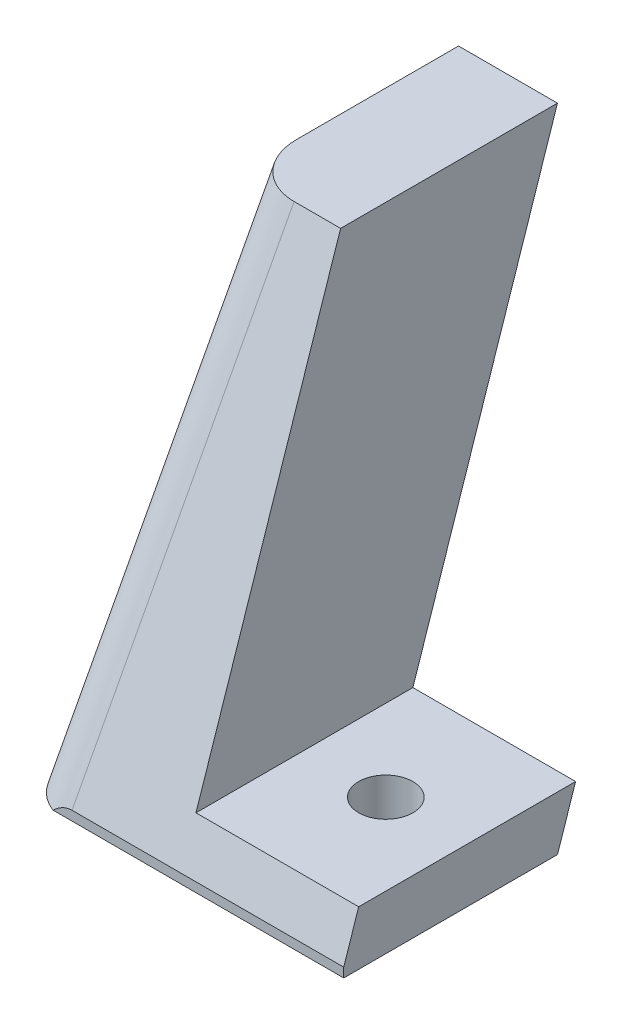
ISO-10303-21;
HEADER;
FILE_DESCRIPTION(('STEP AP214'),'2;1');
FILE_NAME('part.step','',(''),(''),'','','');
FILE_SCHEMA(('AUTOMOTIVE_DESIGN { 1 0 10303 214 1 1 1 1 }'));
ENDSEC;
DATA;
#1=APPLICATION_CONTEXT('core data for automotive mechanical design processes');
#2=APPLICATION_PROTOCOL_DEFINITION('international standard','automotive_design',2000,#1);
#3=PRODUCT_CONTEXT('',#1,'mechanical');
#4=PRODUCT('Part','Part','',(#3));
#5=PRODUCT_RELATED_PRODUCT_CATEGORY('part','',(#4));
#6=PRODUCT_DEFINITION_FORMATION('','',#4);
#7=PRODUCT_DEFINITION_CONTEXT('part definition',#1,'design');
#8=PRODUCT_DEFINITION('design','',#6,#7);
#9=PRODUCT_DEFINITION_SHAPE('','',#8);
#10=(LENGTH_UNIT() NAMED_UNIT(*) SI_UNIT(.MILLI.,.METRE.));
#11=(NAMED_UNIT(*) PLANE_ANGLE_UNIT() SI_UNIT($,.RADIAN.));
#12=(NAMED_UNIT(*) SI_UNIT($,.STERADIAN.) SOLID_ANGLE_UNIT());
#13=UNCERTAINTY_MEASURE_WITH_UNIT(LENGTH_MEASURE(1.E-05),#10,'distance_accuracy_value','');
#14=(GEOMETRIC_REPRESENTATION_CONTEXT(3) GLOBAL_UNCERTAINTY_ASSIGNED_CONTEXT((#13)) GLOBAL_UNIT_ASSIGNED_CONTEXT((#10,
#11,#12)) REPRESENTATION_CONTEXT('',''));
#15=CARTESIAN_POINT('',(0.,0.,0.));
#16=DIRECTION('',(0.,0.,1.));
#17=DIRECTION('',(1.,0.,0.));
#18=AXIS2_PLACEMENT_3D('',#15,#16,#17);
#19=CARTESIAN_POINT('',(-39.546029552466,3.15221063663496,43.9677703351891));
#20=DIRECTION('',(0.122916675240222,0.941489427371917,-0.313829809123972));
#21=DIRECTION('',(0.,0.316227766016838,0.948683298050514));
#22=AXIS2_PLACEMENT_3D('',#19,#20,#21);
#23=CYLINDRICAL_SURFACE('',#22,5.);
#24=DIRECTION('',(0.122916675240222,0.941489427371917,-0.313829809123972));
#25=VECTOR('',#24,1.);
#26=CARTESIAN_POINT('',(-44.5039547778189,3.79949531883381,43.9677703351891));
#27=LINE('',#26,#25);
#28=CARTESIAN_POINT('',(-45.,0.,45.2342687748004));
#29=VERTEX_POINT('',#28);
#30=CARTESIAN_POINT('',(-39.125,45.,30.2342687748004));
#31=VERTEX_POINT('',#30);
#32=EDGE_CURVE('E155',#29,#31,#27,.T.);
#33=ORIENTED_EDGE('',*,*,#32,.F.);
#34=CARTESIAN_POINT('',(-39.95756816336,0.,45.0185072140674));
#35=DIRECTION('',(0.,1.,0.));
#36=DIRECTION('',(0.364691898216784,0.,-0.931128250766262));
#37=AXIS2_PLACEMENT_3D('',#34,#35,#36);
#38=ELLIPSE('',#37,5.31073409284802,5.);
#39=CARTESIAN_POINT('',(-41.7980209045534,0.,50.));
#40=VERTEX_POINT('',#39);
#41=EDGE_CURVE('E43',#40,#29,#38,.F.);
#42=ORIENTED_EDGE('',*,*,#41,.F.);
#43=CARTESIAN_POINT('',(-41.9086528378502,-14.9444783577977,50.));
#44=DIRECTION('',(0.,0.,1.));
#45=DIRECTION('',(0.12945693643977,0.991585045070583,0.));
#46=AXIS2_PLACEMENT_3D('',#43,#44,#45);
#47=ELLIPSE('',#46,15.9322022785441,5.);
#48=CARTESIAN_POINT('',(-40.0508147125013,0.866909943044184,50.));
#49=VERTEX_POINT('',#48);
#50=EDGE_CURVE('E162',#49,#40,#47,.T.);
#51=ORIENTED_EDGE('',*,*,#50,.F.);
#52=DIRECTION('',(0.122916675240222,0.941489427371917,-0.313829809123972));
#53=VECTOR('',#52,1.);
#54=CARTESIAN_POINT('',(-40.3126019980263,-1.13826926523191,50.6683930694254));
#55=LINE('',#54,#53);
#56=CARTESIAN_POINT('',(-34.288994621709,45.0000000001769,35.2889699809558));
#57=VERTEX_POINT('',#56);
#58=EDGE_CURVE('E158',#57,#49,#55,.F.);
#59=ORIENTED_EDGE('',*,*,#58,.F.);
#60=CARTESIAN_POINT('',(-34.08256816336,45.,30.0185072140674));
#61=DIRECTION('',(0.,1.,0.));
#62=DIRECTION('',(0.364691898216784,0.,-0.931128250766262));
#63=AXIS2_PLACEMENT_3D('',#60,#61,#62);
#64=ELLIPSE('',#63,5.31073409284802,5.);
#65=EDGE_CURVE('E11',#31,#57,#64,.T.);
#66=ORIENTED_EDGE('',*,*,#65,.F.);
#67=EDGE_LOOP('',(#33,#42,#51,#59,#66));
#68=FACE_BOUND('',#67,.T.);
#69=ADVANCED_FACE('F36',(#68),#23,.T.);
#70=CARTESIAN_POINT('',(-30.,0.,50.));
#71=DIRECTION('',(-1.,0.,0.));
#72=DIRECTION('',(0.,0.,1.));
#73=AXIS2_PLACEMENT_3D('',#70,#71,#72);
#74=PLANE('',#73);
#75=DIRECTION('',(0.,0.,1.));
#76=VECTOR('',#75,1.);
#77=CARTESIAN_POINT('',(-30.,5.,48.6223033143481));
#78=LINE('',#77,#76);
#79=CARTESIAN_POINT('',(-30.,5.,28.6227831519458));
#80=VERTEX_POINT('',#79);
#81=CARTESIAN_POINT('',(-30.,5.,48.6223033143481));
#82=VERTEX_POINT('',#81);
#83=EDGE_CURVE('E126',#80,#82,#78,.T.);
#84=ORIENTED_EDGE('',*,*,#83,.F.);
#85=DIRECTION('',(0.,-0.948710608132915,0.316145823973803));
#86=VECTOR('',#85,1.);
#87=CARTESIAN_POINT('',(-30.,-5.9119469128284,32.2590515970766));
#88=LINE('',#87,#86);
#89=CARTESIAN_POINT('',(-30.,45.,15.2932885193357));
#90=VERTEX_POINT('',#89);
#91=EDGE_CURVE('E145',#90,#80,#88,.T.);
#92=ORIENTED_EDGE('',*,*,#91,.F.);
#93=DIRECTION('',(0.,0.,-1.));
#94=VECTOR('',#93,1.);
#95=CARTESIAN_POINT('',(-30.,45.,50.));
#96=LINE('',#95,#94);
#97=CARTESIAN_POINT('',(-30.,45.0000000001769,35.2889699809558));
#98=VERTEX_POINT('',#97);
#99=EDGE_CURVE('E168',#98,#90,#96,.T.);
#100=ORIENTED_EDGE('',*,*,#99,.F.);
#101=DIRECTION('',(0.,-0.948683298050514,0.316227766016838));
#102=VECTOR('',#101,1.);
#103=CARTESIAN_POINT('',(-30.,0.0866909943044183,50.2600729829133));
#104=LINE('',#103,#102);
#105=EDGE_CURVE('E109',#98,#82,#104,.T.);
#106=ORIENTED_EDGE('',*,*,#105,.T.);
#107=EDGE_LOOP('',(#84,#92,#100,#106));
#108=FACE_BOUND('',#107,.T.);
#109=ADVANCED_FACE('F192',(#108),#74,.F.);
#110=CARTESIAN_POINT('',(0.,45.,50.));
#111=DIRECTION('',(0.,1.,0.));
#112=DIRECTION('',(0.,0.,1.));
#113=AXIS2_PLACEMENT_3D('',#110,#111,#112);
#114=PLANE('',#113);
#115=DIRECTION('',(0.,0.,-1.));
#116=VECTOR('',#115,1.);
#117=CARTESIAN_POINT('',(-39.125,45.,50.));
#118=LINE('',#117,#116);
#119=CARTESIAN_POINT('',(-39.1249999999769,45.0000000001769,15.2932885193357));
#120=VERTEX_POINT('',#119);
#121=EDGE_CURVE('E167',#31,#120,#118,.T.);
#122=ORIENTED_EDGE('',*,*,#121,.F.);
#123=ORIENTED_EDGE('',*,*,#65,.T.);
#124=DIRECTION('',(1.,0.,0.));
#125=VECTOR('',#124,1.);
#126=CARTESIAN_POINT('',(-50.,45.0000000001769,35.2889699809558));
#127=LINE('',#126,#125);
#128=EDGE_CURVE('E141',#57,#98,#127,.T.);
#129=ORIENTED_EDGE('',*,*,#128,.T.);
#130=ORIENTED_EDGE('',*,*,#99,.T.);
#131=DIRECTION('',(1.,0.,0.));
#132=VECTOR('',#131,1.);
#133=CARTESIAN_POINT('',(-50.,45.0000000001769,15.2932885193357));
#134=LINE('',#133,#132);
#135=EDGE_CURVE('E108',#120,#90,#134,.T.);
#136=ORIENTED_EDGE('',*,*,#135,.F.);
#137=EDGE_LOOP('',(#122,#123,#129,#130,#136));
#138=FACE_BOUND('',#137,.T.);
#139=ADVANCED_FACE('F188',(#138),#114,.T.);
#140=CARTESIAN_POINT('',(-44.2458405723433,5.77654029694479,50.));
#141=DIRECTION('',(0.991585045070583,-0.12945693643977,0.));
#142=DIRECTION('',(0.12945693643977,0.991585045070583,0.));
#143=AXIS2_PLACEMENT_3D('',#140,#141,#142);
#144=PLANE('',#143);
#145=DIRECTION('',(0.,0.,-1.));
#146=VECTOR('',#145,1.);
#147=CARTESIAN_POINT('',(-45.,0.,50.));
#148=LINE('',#147,#146);
#149=CARTESIAN_POINT('',(-45.,0.,30.2889699810147));
#150=VERTEX_POINT('',#149);
#151=EDGE_CURVE('E104',#29,#150,#148,.T.);
#152=ORIENTED_EDGE('',*,*,#151,.F.);
#153=ORIENTED_EDGE('',*,*,#32,.T.);
#154=ORIENTED_EDGE('',*,*,#121,.T.);
#155=DIRECTION('',(0.122920160223209,0.94151612085863,-0.313748351986139));
#156=VECTOR('',#155,1.);
#157=CARTESIAN_POINT('',(-45.0802540777776,-0.614712085105077,30.493815016989));
#158=LINE('',#157,#156);
#159=EDGE_CURVE('E166',#150,#120,#158,.T.);
#160=ORIENTED_EDGE('',*,*,#159,.F.);
#161=EDGE_LOOP('',(#152,#153,#154,#160));
#162=FACE_BOUND('',#161,.T.);
#163=ADVANCED_FACE('F165',(#162),#144,.F.);
#164=CARTESIAN_POINT('',(0.,0.,50.));
#165=DIRECTION('',(0.,1.,0.));
#166=DIRECTION('',(-1.,0.,0.));
#167=AXIS2_PLACEMENT_3D('',#164,#165,#166);
#168=PLANE('',#167);
#169=CARTESIAN_POINT('',(-22.5,0.,38.6225432331469));
#170=DIRECTION('',(0.,1.,0.));
#171=DIRECTION('',(-1.,0.,0.));
#172=AXIS2_PLACEMENT_3D('',#169,#170,#171);
#173=CIRCLE('',#172,2.5);
#174=CARTESIAN_POINT('',(-25.,0.,38.6225432331469));
#175=VERTEX_POINT('',#174);
#176=EDGE_CURVE('E129',#175,#175,#173,.T.);
#177=ORIENTED_EDGE('',*,*,#176,.T.);
#178=EDGE_LOOP('',(#177));
#179=FACE_BOUND('',#178,.T.);
#180=DIRECTION('',(1.,0.,0.));
#181=VECTOR('',#180,1.);
#182=CARTESIAN_POINT('',(0.,0.,50.));
#183=LINE('',#182,#181);
#184=CARTESIAN_POINT('',(-15.,0.,50.));
#185=VERTEX_POINT('',#184);
#186=EDGE_CURVE('E163',#40,#185,#183,.T.);
#187=ORIENTED_EDGE('',*,*,#186,.F.);
#188=ORIENTED_EDGE('',*,*,#41,.T.);
#189=ORIENTED_EDGE('',*,*,#151,.T.);
#190=DIRECTION('',(1.,0.,0.));
#191=VECTOR('',#190,1.);
#192=CARTESIAN_POINT('',(-50.,0.,30.2889699810147));
#193=LINE('',#192,#191);
#194=CARTESIAN_POINT('',(-15.,0.,30.2889699810147));
#195=VERTEX_POINT('',#194);
#196=EDGE_CURVE('E97',#150,#195,#193,.T.);
#197=ORIENTED_EDGE('',*,*,#196,.T.);
#198=DIRECTION('',(0.,0.,-1.));
#199=VECTOR('',#198,1.);
#200=CARTESIAN_POINT('',(-15.,0.,30.2889699810147));
#201=LINE('',#200,#199);
#202=EDGE_CURVE('E102',#185,#195,#201,.T.);
#203=ORIENTED_EDGE('',*,*,#202,.F.);
#204=EDGE_LOOP('',(#187,#188,#189,#197,#203));
#205=FACE_BOUND('',#204,.T.);
#206=ADVANCED_FACE('F100',(#179,#205),#168,.F.);
#207=CARTESIAN_POINT('',(0.,0.,50.));
#208=DIRECTION('',(0.,0.,1.));
#209=DIRECTION('',(1.,0.,0.));
#210=AXIS2_PLACEMENT_3D('',#207,#208,#209);
#211=PLANE('',#210);
#212=DIRECTION('',(1.,0.,0.));
#213=VECTOR('',#212,1.);
#214=CARTESIAN_POINT('',(0.,0.866909943044184,50.));
#215=LINE('',#214,#213);
#216=CARTESIAN_POINT('',(-15.,0.866909943044184,50.));
#217=VERTEX_POINT('',#216);
#218=EDGE_CURVE('E159',#49,#217,#215,.T.);
#219=ORIENTED_EDGE('',*,*,#218,.F.);
#220=ORIENTED_EDGE('',*,*,#50,.T.);
#221=ORIENTED_EDGE('',*,*,#186,.T.);
#222=DIRECTION('',(0.,-1.,0.));
#223=VECTOR('',#222,1.);
#224=CARTESIAN_POINT('',(-15.,0.,50.));
#225=LINE('',#224,#223);
#226=EDGE_CURVE('E125',#217,#185,#225,.T.);
#227=ORIENTED_EDGE('',*,*,#226,.F.);
#228=EDGE_LOOP('',(#219,#220,#221,#227));
#229=FACE_BOUND('',#228,.T.);
#230=ADVANCED_FACE('F181',(#229),#211,.T.);
#231=CARTESIAN_POINT('',(-50.,0.,30.2889699810147));
#232=DIRECTION('',(0.,-0.316145823973803,-0.948710608132915));
#233=DIRECTION('',(0.,0.948710608132915,-0.316145823973803));
#234=AXIS2_PLACEMENT_3D('',#231,#232,#233);
#235=PLANE('',#234);
#236=ORIENTED_EDGE('',*,*,#159,.T.);
#237=ORIENTED_EDGE('',*,*,#135,.T.);
#238=ORIENTED_EDGE('',*,*,#91,.T.);
#239=DIRECTION('',(-1.,0.,0.));
#240=VECTOR('',#239,1.);
#241=CARTESIAN_POINT('',(-15.,5.,28.6227831519393));
#242=LINE('',#241,#240);
#243=CARTESIAN_POINT('',(-15.,5.,28.6227831519393));
#244=VERTEX_POINT('',#243);
#245=EDGE_CURVE('E116',#244,#80,#242,.T.);
#246=ORIENTED_EDGE('',*,*,#245,.F.);
#247=DIRECTION('',(0.,0.948710608132542,-0.316145823974921));
#248=VECTOR('',#247,1.);
#249=CARTESIAN_POINT('',(-15.,5.,28.6227831519393));
#250=LINE('',#249,#248);
#251=EDGE_CURVE('E112',#195,#244,#250,.T.);
#252=ORIENTED_EDGE('',*,*,#251,.F.);
#253=ORIENTED_EDGE('',*,*,#196,.F.);
#254=EDGE_LOOP('',(#236,#237,#238,#246,#252,#253));
#255=FACE_BOUND('',#254,.T.);
#256=ADVANCED_FACE('F113',(#255),#235,.T.);
#257=CARTESIAN_POINT('',(-50.,0.,50.2889699810147));
#258=DIRECTION('',(0.,-0.316227766016838,-0.948683298050514));
#259=DIRECTION('',(0.,0.948683298050514,-0.316227766016838));
#260=AXIS2_PLACEMENT_3D('',#257,#258,#259);
#261=PLANE('',#260);
#262=ORIENTED_EDGE('',*,*,#128,.F.);
#263=ORIENTED_EDGE('',*,*,#58,.T.);
#264=ORIENTED_EDGE('',*,*,#218,.T.);
#265=DIRECTION('',(0.,-0.948683298050514,0.316227766016838));
#266=VECTOR('',#265,1.);
#267=CARTESIAN_POINT('',(-15.,0.866909943044184,50.));
#268=LINE('',#267,#266);
#269=CARTESIAN_POINT('',(-15.,5.,48.6223033143481));
#270=VERTEX_POINT('',#269);
#271=EDGE_CURVE('E135',#270,#217,#268,.T.);
#272=ORIENTED_EDGE('',*,*,#271,.F.);
#273=DIRECTION('',(-1.,0.,0.));
#274=VECTOR('',#273,1.);
#275=CARTESIAN_POINT('',(-15.,5.,48.6223033143481));
#276=LINE('',#275,#274);
#277=EDGE_CURVE('E138',#270,#82,#276,.T.);
#278=ORIENTED_EDGE('',*,*,#277,.T.);
#279=ORIENTED_EDGE('',*,*,#105,.F.);
#280=EDGE_LOOP('',(#262,#263,#264,#272,#278,#279));
#281=FACE_BOUND('',#280,.T.);
#282=ADVANCED_FACE('F184',(#281),#261,.F.);
#283=CARTESIAN_POINT('',(-15.,5.,48.6223033143481));
#284=DIRECTION('',(0.,-1.,0.));
#285=DIRECTION('',(0.,0.,-1.));
#286=AXIS2_PLACEMENT_3D('',#283,#284,#285);
#287=PLANE('',#286);
#288=CARTESIAN_POINT('',(-22.5,5.,38.6225432331469));
#289=DIRECTION('',(0.,1.,0.));
#290=DIRECTION('',(0.,0.,1.));
#291=AXIS2_PLACEMENT_3D('',#288,#289,#290);
#292=CIRCLE('',#291,2.5);
#293=CARTESIAN_POINT('',(-22.5,5.,41.1225432331469));
#294=VERTEX_POINT('',#293);
#295=EDGE_CURVE('E307',#294,#294,#292,.T.);
#296=ORIENTED_EDGE('',*,*,#295,.F.);
#297=EDGE_LOOP('',(#296));
#298=FACE_BOUND('',#297,.T.);
#299=ORIENTED_EDGE('',*,*,#83,.T.);
#300=ORIENTED_EDGE('',*,*,#277,.F.);
#301=DIRECTION('',(0.,0.,1.));
#302=VECTOR('',#301,1.);
#303=CARTESIAN_POINT('',(-15.,5.,48.6223033143481));
#304=LINE('',#303,#302);
#305=EDGE_CURVE('E119',#244,#270,#304,.T.);
#306=ORIENTED_EDGE('',*,*,#305,.F.);
#307=ORIENTED_EDGE('',*,*,#245,.T.);
#308=EDGE_LOOP('',(#299,#300,#306,#307));
#309=FACE_BOUND('',#308,.T.);
#310=ADVANCED_FACE('F195',(#298,#309),#287,.F.);
#311=CARTESIAN_POINT('',(-15.,0.,0.));
#312=DIRECTION('',(-1.,0.,0.));
#313=DIRECTION('',(0.,0.,1.));
#314=AXIS2_PLACEMENT_3D('',#311,#312,#313);
#315=PLANE('',#314);
#316=ORIENTED_EDGE('',*,*,#202,.T.);
#317=ORIENTED_EDGE('',*,*,#251,.T.);
#318=ORIENTED_EDGE('',*,*,#305,.T.);
#319=ORIENTED_EDGE('',*,*,#271,.T.);
#320=ORIENTED_EDGE('',*,*,#226,.T.);
#321=EDGE_LOOP('',(#316,#317,#318,#319,#320));
#322=FACE_BOUND('',#321,.T.);
#323=ADVANCED_FACE('F122',(#322),#315,.F.);
#324=CARTESIAN_POINT('',(-22.5,-10.,38.6225432331469));
#325=DIRECTION('',(0.,1.,0.));
#326=DIRECTION('',(0.,0.,1.));
#327=AXIS2_PLACEMENT_3D('',#324,#325,#326);
#328=CYLINDRICAL_SURFACE('',#327,2.5);
#329=ORIENTED_EDGE('',*,*,#295,.T.);
#330=EDGE_LOOP('',(#329));
#331=FACE_BOUND('',#330,.T.);
#332=ORIENTED_EDGE('',*,*,#176,.F.);
#333=EDGE_LOOP('',(#332));
#334=FACE_BOUND('',#333,.T.);
#335=ADVANCED_FACE('F203',(#331,#334),#328,.F.);
#336=CLOSED_SHELL('',(#69,#109,#139,#163,#206,#230,#256,#282,#310,#323,#335));
#337=MANIFOLD_SOLID_BREP('B2',#336);
#338=ADVANCED_BREP_SHAPE_REPRESENTATION('',(#18,#337),#14);
#339=SHAPE_DEFINITION_REPRESENTATION(#9,#338);
ENDSEC;
END-ISO-10303-21;
